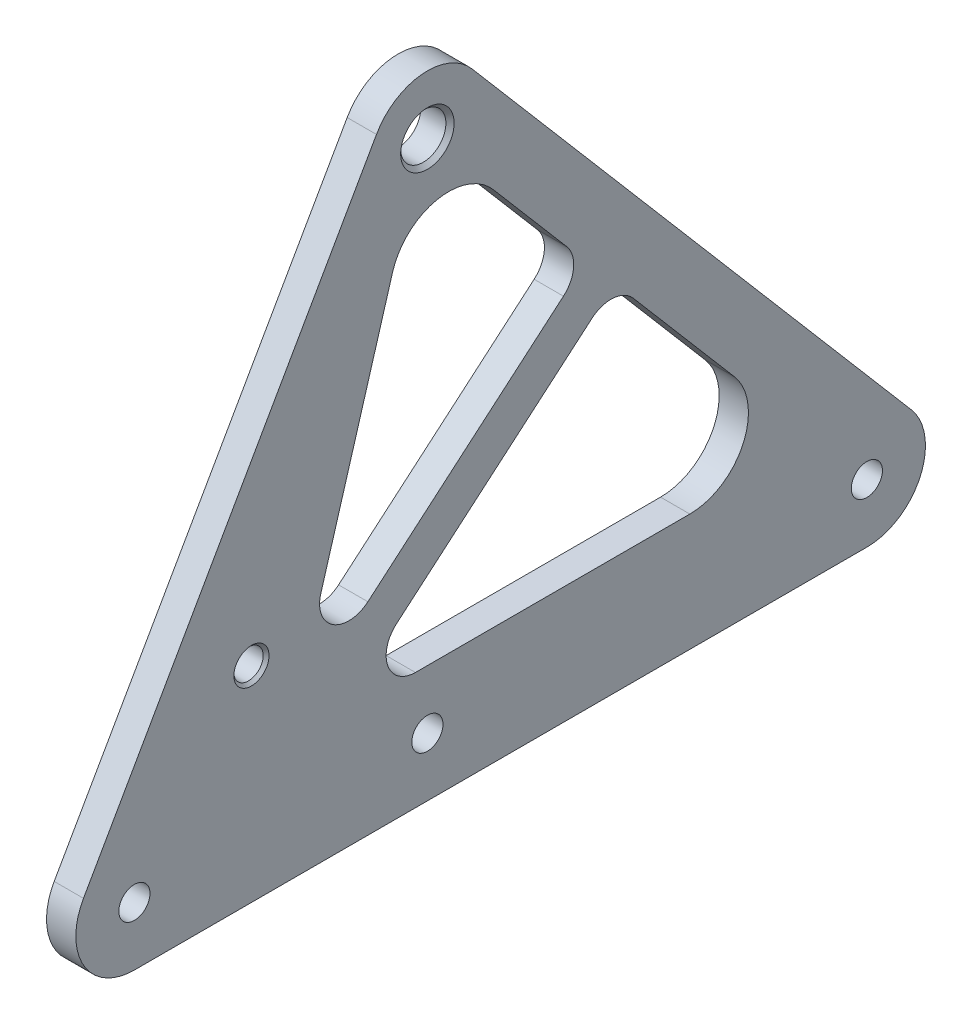
ISO-10303-21;
HEADER;
FILE_DESCRIPTION(('STEP AP214'),'2;1');
FILE_NAME('part.step','',(''),(''),'','','');
FILE_SCHEMA(('AUTOMOTIVE_DESIGN { 1 0 10303 214 1 1 1 1 }'));
ENDSEC;
DATA;
#1=APPLICATION_CONTEXT('core data for automotive mechanical design processes');
#2=APPLICATION_PROTOCOL_DEFINITION('international standard','automotive_design',2000,#1);
#3=PRODUCT_CONTEXT('',#1,'mechanical');
#4=PRODUCT('Part','Part','',(#3));
#5=PRODUCT_RELATED_PRODUCT_CATEGORY('part','',(#4));
#6=PRODUCT_DEFINITION_FORMATION('','',#4);
#7=PRODUCT_DEFINITION_CONTEXT('part definition',#1,'design');
#8=PRODUCT_DEFINITION('design','',#6,#7);
#9=PRODUCT_DEFINITION_SHAPE('','',#8);
#10=(LENGTH_UNIT() NAMED_UNIT(*) SI_UNIT(.MILLI.,.METRE.));
#11=(NAMED_UNIT(*) PLANE_ANGLE_UNIT() SI_UNIT($,.RADIAN.));
#12=(NAMED_UNIT(*) SI_UNIT($,.STERADIAN.) SOLID_ANGLE_UNIT());
#13=UNCERTAINTY_MEASURE_WITH_UNIT(LENGTH_MEASURE(1.E-05),#10,'distance_accuracy_value','');
#14=(GEOMETRIC_REPRESENTATION_CONTEXT(3) GLOBAL_UNCERTAINTY_ASSIGNED_CONTEXT((#13)) GLOBAL_UNIT_ASSIGNED_CONTEXT((#10,
#11,#12)) REPRESENTATION_CONTEXT('',''));
#15=CARTESIAN_POINT('',(0.,0.,0.));
#16=DIRECTION('',(0.,0.,1.));
#17=DIRECTION('',(1.,0.,0.));
#18=AXIS2_PLACEMENT_3D('',#15,#16,#17);
#19=CARTESIAN_POINT('',(6.35,0.,0.));
#20=DIRECTION('',(-1.,0.,0.));
#21=DIRECTION('',(0.,0.,1.));
#22=AXIS2_PLACEMENT_3D('',#19,#20,#21);
#23=CYLINDRICAL_SURFACE('',#22,12.7);
#24=CARTESIAN_POINT('',(0.,0.,0.));
#25=DIRECTION('',(1.,0.,0.));
#26=DIRECTION('',(0.,0.,-1.));
#27=AXIS2_PLACEMENT_3D('',#24,#25,#26);
#28=CIRCLE('',#27,12.7);
#29=CARTESIAN_POINT('',(0.,8.24330593271423,-9.66115455314108));
#30=VERTEX_POINT('',#29);
#31=CARTESIAN_POINT('',(0.,6.27931290545756,11.0390320877944));
#32=VERTEX_POINT('',#31);
#33=EDGE_CURVE('E283',#30,#32,#28,.T.);
#34=ORIENTED_EDGE('',*,*,#33,.T.);
#35=DIRECTION('',(-1.,0.,0.));
#36=VECTOR('',#35,1.);
#37=CARTESIAN_POINT('',(6.35,6.27931290545756,11.0390320877944));
#38=LINE('',#37,#36);
#39=CARTESIAN_POINT('',(6.35,6.27931290545756,11.0390320877944));
#40=VERTEX_POINT('',#39);
#41=EDGE_CURVE('E11',#40,#32,#38,.T.);
#42=ORIENTED_EDGE('',*,*,#41,.F.);
#43=CARTESIAN_POINT('',(6.35,0.,0.));
#44=DIRECTION('',(1.,0.,0.));
#45=DIRECTION('',(0.,0.,-1.));
#46=AXIS2_PLACEMENT_3D('',#43,#44,#45);
#47=CIRCLE('',#46,12.7);
#48=CARTESIAN_POINT('',(6.35,8.24330593271423,-9.66115455314108));
#49=VERTEX_POINT('',#48);
#50=EDGE_CURVE('E294',#49,#40,#47,.T.);
#51=ORIENTED_EDGE('',*,*,#50,.F.);
#52=DIRECTION('',(-1.,0.,0.));
#53=VECTOR('',#52,1.);
#54=CARTESIAN_POINT('',(6.35,8.24330593271423,-9.66115455314108));
#55=LINE('',#54,#53);
#56=EDGE_CURVE('E309',#49,#30,#55,.T.);
#57=ORIENTED_EDGE('',*,*,#56,.T.);
#58=EDGE_LOOP('',(#34,#42,#51,#57));
#59=FACE_BOUND('',#58,.T.);
#60=ADVANCED_FACE('F33',(#59),#23,.T.);
#61=CARTESIAN_POINT('',(6.35,-105.353687094542,74.5390320877944));
#62=DIRECTION('',(0.,0.494434087043902,0.86921512502318));
#63=DIRECTION('',(0.,-0.86921512502318,0.494434087043902));
#64=AXIS2_PLACEMENT_3D('',#61,#62,#63);
#65=PLANE('',#64);
#66=DIRECTION('',(0.,0.86921512502318,-0.494434087043902));
#67=VECTOR('',#66,1.);
#68=CARTESIAN_POINT('',(0.,-105.353687094542,74.5390320877944));
#69=LINE('',#68,#67);
#70=CARTESIAN_POINT('',(0.,-105.353687094542,74.5390320877944));
#71=VERTEX_POINT('',#70);
#72=EDGE_CURVE('E312',#71,#32,#69,.T.);
#73=ORIENTED_EDGE('',*,*,#72,.F.);
#74=DIRECTION('',(-1.,0.,0.));
#75=VECTOR('',#74,1.);
#76=CARTESIAN_POINT('',(6.35,-105.353687094542,74.5390320877944));
#77=LINE('',#76,#75);
#78=CARTESIAN_POINT('',(6.35,-105.353687094542,74.5390320877944));
#79=VERTEX_POINT('',#78);
#80=EDGE_CURVE('E40',#79,#71,#77,.T.);
#81=ORIENTED_EDGE('',*,*,#80,.F.);
#82=DIRECTION('',(0.,0.86921512502318,-0.494434087043902));
#83=VECTOR('',#82,1.);
#84=CARTESIAN_POINT('',(6.35,-105.353687094542,74.5390320877944));
#85=LINE('',#84,#83);
#86=EDGE_CURVE('E296',#79,#40,#85,.T.);
#87=ORIENTED_EDGE('',*,*,#86,.T.);
#88=ORIENTED_EDGE('',*,*,#41,.T.);
#89=EDGE_LOOP('',(#73,#81,#87,#88));
#90=FACE_BOUND('',#89,.T.);
#91=ADVANCED_FACE('F344',(#90),#65,.T.);
#92=CARTESIAN_POINT('',(6.35,-111.633,63.5));
#93=DIRECTION('',(-1.,0.,0.));
#94=DIRECTION('',(0.,0.,1.));
#95=AXIS2_PLACEMENT_3D('',#92,#93,#94);
#96=CYLINDRICAL_SURFACE('',#95,12.7);
#97=CARTESIAN_POINT('',(0.,-111.633,63.5));
#98=DIRECTION('',(1.,0.,0.));
#99=DIRECTION('',(0.,0.,-1.));
#100=AXIS2_PLACEMENT_3D('',#97,#98,#99);
#101=CIRCLE('',#100,12.7);
#102=CARTESIAN_POINT('',(0.,-124.333,63.5));
#103=VERTEX_POINT('',#102);
#104=EDGE_CURVE('E315',#71,#103,#101,.T.);
#105=ORIENTED_EDGE('',*,*,#104,.T.);
#106=DIRECTION('',(-1.,0.,0.));
#107=VECTOR('',#106,1.);
#108=CARTESIAN_POINT('',(6.35,-124.333,63.5));
#109=LINE('',#108,#107);
#110=CARTESIAN_POINT('',(6.35,-124.333,63.5));
#111=VERTEX_POINT('',#110);
#112=EDGE_CURVE('E330',#111,#103,#109,.T.);
#113=ORIENTED_EDGE('',*,*,#112,.F.);
#114=CARTESIAN_POINT('',(6.35,-111.633,63.5));
#115=DIRECTION('',(1.,0.,0.));
#116=DIRECTION('',(0.,0.,-1.));
#117=AXIS2_PLACEMENT_3D('',#114,#115,#116);
#118=CIRCLE('',#117,12.7);
#119=EDGE_CURVE('E300',#79,#111,#118,.T.);
#120=ORIENTED_EDGE('',*,*,#119,.F.);
#121=ORIENTED_EDGE('',*,*,#80,.T.);
#122=EDGE_LOOP('',(#105,#113,#120,#121));
#123=FACE_BOUND('',#122,.T.);
#124=ADVANCED_FACE('F335',(#123),#96,.T.);
#125=CARTESIAN_POINT('',(6.35,-124.333,63.5));
#126=DIRECTION('',(0.,1.,0.));
#127=DIRECTION('',(0.,0.,1.));
#128=AXIS2_PLACEMENT_3D('',#125,#126,#127);
#129=PLANE('',#128);
#130=DIRECTION('',(0.,0.,-1.));
#131=VECTOR('',#130,1.);
#132=CARTESIAN_POINT('',(0.,-124.333,63.5));
#133=LINE('',#132,#131);
#134=CARTESIAN_POINT('',(0.,-124.333,-95.25));
#135=VERTEX_POINT('',#134);
#136=EDGE_CURVE('E317',#103,#135,#133,.T.);
#137=ORIENTED_EDGE('',*,*,#136,.T.);
#138=DIRECTION('',(-1.,0.,0.));
#139=VECTOR('',#138,1.);
#140=CARTESIAN_POINT('',(6.35,-124.333,-95.25));
#141=LINE('',#140,#139);
#142=CARTESIAN_POINT('',(6.35,-124.333,-95.25));
#143=VERTEX_POINT('',#142);
#144=EDGE_CURVE('E327',#143,#135,#141,.T.);
#145=ORIENTED_EDGE('',*,*,#144,.F.);
#146=DIRECTION('',(0.,0.,-1.));
#147=VECTOR('',#146,1.);
#148=CARTESIAN_POINT('',(6.35,-124.333,63.5));
#149=LINE('',#148,#147);
#150=EDGE_CURVE('E302',#111,#143,#149,.T.);
#151=ORIENTED_EDGE('',*,*,#150,.F.);
#152=ORIENTED_EDGE('',*,*,#112,.T.);
#153=EDGE_LOOP('',(#137,#145,#151,#152));
#154=FACE_BOUND('',#153,.T.);
#155=ADVANCED_FACE('F359',(#154),#129,.F.);
#156=CARTESIAN_POINT('',(6.35,-111.633,-95.25));
#157=DIRECTION('',(-1.,0.,0.));
#158=DIRECTION('',(0.,0.,1.));
#159=AXIS2_PLACEMENT_3D('',#156,#157,#158);
#160=CYLINDRICAL_SURFACE('',#159,12.7);
#161=CARTESIAN_POINT('',(0.,-111.633,-95.25));
#162=DIRECTION('',(1.,0.,0.));
#163=DIRECTION('',(0.,0.,-1.));
#164=AXIS2_PLACEMENT_3D('',#161,#162,#163);
#165=CIRCLE('',#164,12.7);
#166=CARTESIAN_POINT('',(0.,-103.389694067286,-104.911154553141));
#167=VERTEX_POINT('',#166);
#168=EDGE_CURVE('E319',#135,#167,#165,.T.);
#169=ORIENTED_EDGE('',*,*,#168,.T.);
#170=DIRECTION('',(-1.,0.,0.));
#171=VECTOR('',#170,1.);
#172=CARTESIAN_POINT('',(6.35,-103.389694067286,-104.911154553141));
#173=LINE('',#172,#171);
#174=CARTESIAN_POINT('',(6.35,-103.389694067286,-104.911154553141));
#175=VERTEX_POINT('',#174);
#176=EDGE_CURVE('E325',#175,#167,#173,.T.);
#177=ORIENTED_EDGE('',*,*,#176,.F.);
#178=CARTESIAN_POINT('',(6.35,-111.633,-95.25));
#179=DIRECTION('',(1.,0.,0.));
#180=DIRECTION('',(0.,0.,-1.));
#181=AXIS2_PLACEMENT_3D('',#178,#179,#180);
#182=CIRCLE('',#181,12.7);
#183=EDGE_CURVE('E304',#143,#175,#182,.T.);
#184=ORIENTED_EDGE('',*,*,#183,.F.);
#185=ORIENTED_EDGE('',*,*,#144,.T.);
#186=EDGE_LOOP('',(#169,#177,#184,#185));
#187=FACE_BOUND('',#186,.T.);
#188=ADVANCED_FACE('F355',(#187),#160,.T.);
#189=CARTESIAN_POINT('',(6.35,8.24330593271423,-9.66115455314108));
#190=DIRECTION('',(0.,0.649079207300333,-0.76072083095599));
#191=DIRECTION('',(0.,0.76072083095599,0.649079207300333));
#192=AXIS2_PLACEMENT_3D('',#189,#190,#191);
#193=PLANE('',#192);
#194=DIRECTION('',(0.,-0.76072083095599,-0.649079207300333));
#195=VECTOR('',#194,1.);
#196=CARTESIAN_POINT('',(0.,8.24330593271423,-9.66115455314108));
#197=LINE('',#196,#195);
#198=EDGE_CURVE('E297',#30,#167,#197,.T.);
#199=ORIENTED_EDGE('',*,*,#198,.F.);
#200=ORIENTED_EDGE('',*,*,#56,.F.);
#201=DIRECTION('',(0.,-0.76072083095599,-0.649079207300333));
#202=VECTOR('',#201,1.);
#203=CARTESIAN_POINT('',(6.35,8.24330593271423,-9.66115455314108));
#204=LINE('',#203,#202);
#205=EDGE_CURVE('E306',#49,#175,#204,.T.);
#206=ORIENTED_EDGE('',*,*,#205,.T.);
#207=ORIENTED_EDGE('',*,*,#176,.T.);
#208=EDGE_LOOP('',(#199,#200,#206,#207));
#209=FACE_BOUND('',#208,.T.);
#210=ADVANCED_FACE('F350',(#209),#193,.T.);
#211=CARTESIAN_POINT('',(6.35,0.,0.));
#212=DIRECTION('',(1.,0.,0.));
#213=DIRECTION('',(0.,0.,-1.));
#214=AXIS2_PLACEMENT_3D('',#211,#212,#213);
#215=PLANE('',#214);
#216=CARTESIAN_POINT('',(6.35,-86.233,-56.8829530128024));
#217=DIRECTION('',(1.,0.,0.));
#218=DIRECTION('',(0.,0.,-1.));
#219=AXIS2_PLACEMENT_3D('',#216,#217,#218);
#220=CIRCLE('',#219,12.7);
#221=CARTESIAN_POINT('',(6.35,-98.933,-56.8829530128024));
#222=VERTEX_POINT('',#221);
#223=CARTESIAN_POINT('',(6.35,-77.9896940672858,-66.5441075659435));
#224=VERTEX_POINT('',#223);
#225=EDGE_CURVE('E47',#222,#224,#220,.T.);
#226=ORIENTED_EDGE('',*,*,#225,.F.);
#227=DIRECTION('',(0.,0.,-1.));
#228=VECTOR('',#227,1.);
#229=CARTESIAN_POINT('',(6.35,-98.933,2.59472714719857));
#230=LINE('',#229,#228);
#231=CARTESIAN_POINT('',(6.35,-98.933,2.59472714719857));
#232=VERTEX_POINT('',#231);
#233=EDGE_CURVE('E178',#232,#222,#230,.T.);
#234=ORIENTED_EDGE('',*,*,#233,.F.);
#235=CARTESIAN_POINT('',(6.35,-92.583,2.59472714719857));
#236=DIRECTION('',(1.,0.,0.));
#237=DIRECTION('',(0.,0.,1.));
#238=AXIS2_PLACEMENT_3D('',#235,#236,#237);
#239=CIRCLE('',#238,6.35);
#240=CARTESIAN_POINT('',(6.35,-87.7524227234295,6.71638011355568));
#241=VERTEX_POINT('',#240);
#242=EDGE_CURVE('E181',#241,#232,#239,.T.);
#243=ORIENTED_EDGE('',*,*,#242,.F.);
#244=DIRECTION('',(0.,-0.649079207300333,0.76072083095599));
#245=VECTOR('',#244,1.);
#246=CARTESIAN_POINT('',(6.35,-87.7524227234295,6.71638011355568));
#247=LINE('',#246,#245);
#248=CARTESIAN_POINT('',(6.35,-51.58731094225,-35.6691308939866));
#249=VERTEX_POINT('',#248);
#250=EDGE_CURVE('E197',#249,#241,#247,.T.);
#251=ORIENTED_EDGE('',*,*,#250,.F.);
#252=CARTESIAN_POINT('',(6.35,-56.4178882188206,-39.7907838603437));
#253=DIRECTION('',(1.,0.,0.));
#254=DIRECTION('',(0.,0.,-1.));
#255=AXIS2_PLACEMENT_3D('',#252,#253,#254);
#256=CIRCLE('',#255,6.35000000000001);
#257=CARTESIAN_POINT('',(6.35,-52.2962352524634,-44.6213611369142));
#258=VERTEX_POINT('',#257);
#259=EDGE_CURVE('E194',#258,#249,#256,.T.);
#260=ORIENTED_EDGE('',*,*,#259,.F.);
#261=DIRECTION('',(0.,0.76072083095599,0.649079207300333));
#262=VECTOR('',#261,1.);
#263=CARTESIAN_POINT('',(6.35,-77.9896940672858,-66.5441075659435));
#264=LINE('',#263,#262);
#265=EDGE_CURVE('E192',#224,#258,#264,.T.);
#266=ORIENTED_EDGE('',*,*,#265,.F.);
#267=EDGE_LOOP('',(#226,#234,#243,#251,#260,#266));
#268=FACE_BOUND('',#267,.T.);
#269=CARTESIAN_POINT('',(6.35,-39.5108677508237,-25.3649984780938));
#270=DIRECTION('',(1.,0.,0.));
#271=DIRECTION('',(0.,0.,1.));
#272=AXIS2_PLACEMENT_3D('',#269,#270,#271);
#273=CIRCLE('',#272,6.35);
#274=CARTESIAN_POINT('',(6.35,-44.3414450273942,-29.4866514444509));
#275=VERTEX_POINT('',#274);
#276=CARTESIAN_POINT('',(6.35,-35.3892147844666,-30.1955757546643));
#277=VERTEX_POINT('',#276);
#278=EDGE_CURVE('E55',#275,#277,#273,.T.);
#279=ORIENTED_EDGE('',*,*,#278,.F.);
#280=DIRECTION('',(0.,0.649079207300333,-0.76072083095599));
#281=VECTOR('',#280,1.);
#282=CARTESIAN_POINT('',(6.35,-80.5065568085737,12.8988595630914));
#283=LINE('',#282,#281);
#284=CARTESIAN_POINT('',(6.35,-80.5065568085737,12.8988595630913));
#285=VERTEX_POINT('',#284);
#286=EDGE_CURVE('E215',#285,#275,#283,.T.);
#287=ORIENTED_EDGE('',*,*,#286,.F.);
#288=CARTESIAN_POINT('',(6.35,-75.6759795320031,17.0205125294485));
#289=DIRECTION('',(1.,0.,0.));
#290=DIRECTION('',(0.,0.,1.));
#291=AXIS2_PLACEMENT_3D('',#288,#289,#290);
#292=CIRCLE('',#291,6.35);
#293=CARTESIAN_POINT('',(6.35,-73.8728328104251,23.1091217220689));
#294=VERTEX_POINT('',#293);
#295=EDGE_CURVE('E241',#294,#285,#292,.T.);
#296=ORIENTED_EDGE('',*,*,#295,.F.);
#297=DIRECTION('',(0.,-0.958836093326057,0.283960113634336));
#298=VECTOR('',#297,1.);
#299=CARTESIAN_POINT('',(6.35,-21.3706230353739,7.560548240587));
#300=LINE('',#299,#298);
#301=CARTESIAN_POINT('',(6.35,-21.3706230353739,7.56054824058699));
#302=VERTEX_POINT('',#301);
#303=EDGE_CURVE('E238',#302,#294,#300,.T.);
#304=ORIENTED_EDGE('',*,*,#303,.F.);
#305=CARTESIAN_POINT('',(6.35,-24.97691647853,-4.61667014465393));
#306=DIRECTION('',(1.,0.,0.));
#307=DIRECTION('',(0.,0.,-1.));
#308=AXIS2_PLACEMENT_3D('',#305,#306,#307);
#309=CIRCLE('',#308,12.7);
#310=CARTESIAN_POINT('',(6.35,-16.7336105458157,-14.277824697795));
#311=VERTEX_POINT('',#310);
#312=EDGE_CURVE('E235',#311,#302,#309,.T.);
#313=ORIENTED_EDGE('',*,*,#312,.F.);
#314=DIRECTION('',(0.,0.76072083095599,0.649079207300333));
#315=VECTOR('',#314,1.);
#316=CARTESIAN_POINT('',(6.35,-35.3892147844666,-30.1955757546643));
#317=LINE('',#316,#315);
#318=EDGE_CURVE('E232',#277,#311,#317,.T.);
#319=ORIENTED_EDGE('',*,*,#318,.F.);
#320=EDGE_LOOP('',(#279,#287,#296,#304,#313,#319));
#321=FACE_BOUND('',#320,.T.);
#322=CARTESIAN_POINT('',(6.35,-79.883,38.1342629932309));
#323=DIRECTION('',(1.,0.,0.));
#324=DIRECTION('',(0.,0.,-1.));
#325=AXIS2_PLACEMENT_3D('',#322,#323,#324);
#326=CIRCLE('',#325,3.80999999999999);
#327=CARTESIAN_POINT('',(6.35,-79.883,34.3242629932309));
#328=VERTEX_POINT('',#327);
#329=EDGE_CURVE('E248',#328,#328,#326,.T.);
#330=ORIENTED_EDGE('',*,*,#329,.F.);
#331=EDGE_LOOP('',(#330));
#332=FACE_BOUND('',#331,.T.);
#333=CARTESIAN_POINT('',(6.35,0.,0.));
#334=DIRECTION('',(1.,0.,0.));
#335=DIRECTION('',(0.,0.,-1.));
#336=AXIS2_PLACEMENT_3D('',#333,#334,#335);
#337=CIRCLE('',#336,5.79374);
#338=CARTESIAN_POINT('',(6.35,0.,-5.79374));
#339=VERTEX_POINT('',#338);
#340=EDGE_CURVE('E266',#339,#339,#337,.T.);
#341=ORIENTED_EDGE('',*,*,#340,.F.);
#342=EDGE_LOOP('',(#341));
#343=FACE_BOUND('',#342,.T.);
#344=CARTESIAN_POINT('',(6.35,-111.633,63.5));
#345=DIRECTION('',(1.,0.,0.));
#346=DIRECTION('',(0.,0.,-1.));
#347=AXIS2_PLACEMENT_3D('',#344,#345,#346);
#348=CIRCLE('',#347,3.3782);
#349=CARTESIAN_POINT('',(6.35,-111.633,60.1218));
#350=VERTEX_POINT('',#349);
#351=EDGE_CURVE('E276',#350,#350,#348,.T.);
#352=ORIENTED_EDGE('',*,*,#351,.F.);
#353=EDGE_LOOP('',(#352));
#354=FACE_BOUND('',#353,.T.);
#355=CARTESIAN_POINT('',(6.35,-111.633,0.));
#356=DIRECTION('',(1.,0.,0.));
#357=DIRECTION('',(0.,0.,-1.));
#358=AXIS2_PLACEMENT_3D('',#355,#356,#357);
#359=CIRCLE('',#358,3.37819999999999);
#360=CARTESIAN_POINT('',(6.35,-111.633,-3.3782));
#361=VERTEX_POINT('',#360);
#362=EDGE_CURVE('E284',#361,#361,#359,.T.);
#363=ORIENTED_EDGE('',*,*,#362,.F.);
#364=EDGE_LOOP('',(#363));
#365=FACE_BOUND('',#364,.T.);
#366=CARTESIAN_POINT('',(6.35,-111.633,-95.25));
#367=DIRECTION('',(1.,0.,0.));
#368=DIRECTION('',(0.,0.,-1.));
#369=AXIS2_PLACEMENT_3D('',#366,#367,#368);
#370=CIRCLE('',#369,3.37819999999999);
#371=CARTESIAN_POINT('',(6.35,-111.633,-98.6282));
#372=VERTEX_POINT('',#371);
#373=EDGE_CURVE('E275',#372,#372,#370,.T.);
#374=ORIENTED_EDGE('',*,*,#373,.F.);
#375=EDGE_LOOP('',(#374));
#376=FACE_BOUND('',#375,.T.);
#377=ORIENTED_EDGE('',*,*,#50,.T.);
#378=ORIENTED_EDGE('',*,*,#86,.F.);
#379=ORIENTED_EDGE('',*,*,#119,.T.);
#380=ORIENTED_EDGE('',*,*,#150,.T.);
#381=ORIENTED_EDGE('',*,*,#183,.T.);
#382=ORIENTED_EDGE('',*,*,#205,.F.);
#383=EDGE_LOOP('',(#377,#378,#379,#380,#381,#382));
#384=FACE_BOUND('',#383,.T.);
#385=ADVANCED_FACE('F361',(#268,#321,#332,#343,#354,#365,#376,#384),#215,.T.);
#386=CARTESIAN_POINT('',(0.,0.,0.));
#387=DIRECTION('',(1.,0.,0.));
#388=DIRECTION('',(0.,0.,-1.));
#389=AXIS2_PLACEMENT_3D('',#386,#387,#388);
#390=PLANE('',#389);
#391=DIRECTION('',(0.,0.,-1.));
#392=VECTOR('',#391,1.);
#393=CARTESIAN_POINT('',(0.,-98.933,2.59472714719857));
#394=LINE('',#393,#392);
#395=CARTESIAN_POINT('',(0.,-98.933,2.59472714719857));
#396=VERTEX_POINT('',#395);
#397=CARTESIAN_POINT('',(0.,-98.933,-56.8829530128024));
#398=VERTEX_POINT('',#397);
#399=EDGE_CURVE('E164',#396,#398,#394,.T.);
#400=ORIENTED_EDGE('',*,*,#399,.T.);
#401=CARTESIAN_POINT('',(0.,-86.233,-56.8829530128024));
#402=DIRECTION('',(1.,0.,0.));
#403=DIRECTION('',(0.,0.,-1.));
#404=AXIS2_PLACEMENT_3D('',#401,#402,#403);
#405=CIRCLE('',#404,12.7);
#406=CARTESIAN_POINT('',(0.,-77.9896940672858,-66.5441075659435));
#407=VERTEX_POINT('',#406);
#408=EDGE_CURVE('E158',#398,#407,#405,.T.);
#409=ORIENTED_EDGE('',*,*,#408,.T.);
#410=DIRECTION('',(0.,0.76072083095599,0.649079207300333));
#411=VECTOR('',#410,1.);
#412=CARTESIAN_POINT('',(0.,-77.9896940672858,-66.5441075659435));
#413=LINE('',#412,#411);
#414=CARTESIAN_POINT('',(0.,-52.2962352524635,-44.6213611369142));
#415=VERTEX_POINT('',#414);
#416=EDGE_CURVE('E168',#407,#415,#413,.T.);
#417=ORIENTED_EDGE('',*,*,#416,.T.);
#418=CARTESIAN_POINT('',(0.,-56.4178882188206,-39.7907838603437));
#419=DIRECTION('',(1.,0.,0.));
#420=DIRECTION('',(0.,0.,-1.));
#421=AXIS2_PLACEMENT_3D('',#418,#419,#420);
#422=CIRCLE('',#421,6.35000000000001);
#423=CARTESIAN_POINT('',(0.,-51.58731094225,-35.6691308939866));
#424=VERTEX_POINT('',#423);
#425=EDGE_CURVE('E172',#415,#424,#422,.T.);
#426=ORIENTED_EDGE('',*,*,#425,.T.);
#427=DIRECTION('',(0.,-0.649079207300333,0.76072083095599));
#428=VECTOR('',#427,1.);
#429=CARTESIAN_POINT('',(0.,-87.7524227234295,6.71638011355568));
#430=LINE('',#429,#428);
#431=CARTESIAN_POINT('',(0.,-87.7524227234295,6.71638011355568));
#432=VERTEX_POINT('',#431);
#433=EDGE_CURVE('E185',#424,#432,#430,.T.);
#434=ORIENTED_EDGE('',*,*,#433,.T.);
#435=CARTESIAN_POINT('',(0.,-92.583,2.59472714719857));
#436=DIRECTION('',(1.,0.,0.));
#437=DIRECTION('',(0.,0.,1.));
#438=AXIS2_PLACEMENT_3D('',#435,#436,#437);
#439=CIRCLE('',#438,6.35);
#440=EDGE_CURVE('E188',#432,#396,#439,.T.);
#441=ORIENTED_EDGE('',*,*,#440,.T.);
#442=EDGE_LOOP('',(#400,#409,#417,#426,#434,#441));
#443=FACE_BOUND('',#442,.T.);
#444=DIRECTION('',(0.,0.649079207300333,-0.76072083095599));
#445=VECTOR('',#444,1.);
#446=CARTESIAN_POINT('',(0.,-80.5065568085737,12.8988595630914));
#447=LINE('',#446,#445);
#448=CARTESIAN_POINT('',(0.,-80.5065568085737,12.8988595630913));
#449=VERTEX_POINT('',#448);
#450=CARTESIAN_POINT('',(0.,-44.3414450273942,-29.4866514444509));
#451=VERTEX_POINT('',#450);
#452=EDGE_CURVE('E227',#449,#451,#447,.T.);
#453=ORIENTED_EDGE('',*,*,#452,.T.);
#454=CARTESIAN_POINT('',(0.,-39.5108677508237,-25.3649984780938));
#455=DIRECTION('',(1.,0.,0.));
#456=DIRECTION('',(0.,0.,1.));
#457=AXIS2_PLACEMENT_3D('',#454,#455,#456);
#458=CIRCLE('',#457,6.35);
#459=CARTESIAN_POINT('',(0.,-35.3892147844666,-30.1955757546643));
#460=VERTEX_POINT('',#459);
#461=EDGE_CURVE('E211',#451,#460,#458,.T.);
#462=ORIENTED_EDGE('',*,*,#461,.T.);
#463=DIRECTION('',(0.,0.76072083095599,0.649079207300333));
#464=VECTOR('',#463,1.);
#465=CARTESIAN_POINT('',(0.,-35.3892147844666,-30.1955757546643));
#466=LINE('',#465,#464);
#467=CARTESIAN_POINT('',(0.,-16.7336105458157,-14.277824697795));
#468=VERTEX_POINT('',#467);
#469=EDGE_CURVE('E214',#460,#468,#466,.T.);
#470=ORIENTED_EDGE('',*,*,#469,.T.);
#471=CARTESIAN_POINT('',(0.,-24.97691647853,-4.61667014465393));
#472=DIRECTION('',(1.,0.,0.));
#473=DIRECTION('',(0.,0.,-1.));
#474=AXIS2_PLACEMENT_3D('',#471,#472,#473);
#475=CIRCLE('',#474,12.7);
#476=CARTESIAN_POINT('',(0.,-21.3706230353739,7.56054824058699));
#477=VERTEX_POINT('',#476);
#478=EDGE_CURVE('E218',#468,#477,#475,.T.);
#479=ORIENTED_EDGE('',*,*,#478,.T.);
#480=DIRECTION('',(0.,-0.958836093326057,0.283960113634336));
#481=VECTOR('',#480,1.);
#482=CARTESIAN_POINT('',(0.,-21.3706230353739,7.560548240587));
#483=LINE('',#482,#481);
#484=CARTESIAN_POINT('',(0.,-73.8728328104251,23.1091217220689));
#485=VERTEX_POINT('',#484);
#486=EDGE_CURVE('E221',#477,#485,#483,.T.);
#487=ORIENTED_EDGE('',*,*,#486,.T.);
#488=CARTESIAN_POINT('',(0.,-75.6759795320031,17.0205125294485));
#489=DIRECTION('',(1.,0.,0.));
#490=DIRECTION('',(0.,0.,1.));
#491=AXIS2_PLACEMENT_3D('',#488,#489,#490);
#492=CIRCLE('',#491,6.35);
#493=EDGE_CURVE('E224',#485,#449,#492,.T.);
#494=ORIENTED_EDGE('',*,*,#493,.T.);
#495=EDGE_LOOP('',(#453,#462,#470,#479,#487,#494));
#496=FACE_BOUND('',#495,.T.);
#497=CARTESIAN_POINT('',(0.,-79.883,38.1342629932309));
#498=DIRECTION('',(1.,0.,0.));
#499=DIRECTION('',(0.,0.,-1.));
#500=AXIS2_PLACEMENT_3D('',#497,#498,#499);
#501=CIRCLE('',#500,3.175);
#502=CARTESIAN_POINT('',(0.,-79.883,34.9592629932309));
#503=VERTEX_POINT('',#502);
#504=EDGE_CURVE('E263',#503,#503,#501,.T.);
#505=ORIENTED_EDGE('',*,*,#504,.T.);
#506=EDGE_LOOP('',(#505));
#507=FACE_BOUND('',#506,.T.);
#508=CARTESIAN_POINT('',(0.,0.,0.));
#509=DIRECTION('',(1.,0.,0.));
#510=DIRECTION('',(0.,0.,-1.));
#511=AXIS2_PLACEMENT_3D('',#508,#509,#510);
#512=CIRCLE('',#511,4.90219999999999);
#513=CARTESIAN_POINT('',(0.,0.,-4.90219999999999));
#514=VERTEX_POINT('',#513);
#515=EDGE_CURVE('E272',#514,#514,#512,.T.);
#516=ORIENTED_EDGE('',*,*,#515,.T.);
#517=EDGE_LOOP('',(#516));
#518=FACE_BOUND('',#517,.T.);
#519=CARTESIAN_POINT('',(0.,-111.633,63.5));
#520=DIRECTION('',(1.,0.,0.));
#521=DIRECTION('',(0.,0.,-1.));
#522=AXIS2_PLACEMENT_3D('',#519,#520,#521);
#523=CIRCLE('',#522,3.3782);
#524=CARTESIAN_POINT('',(0.,-111.633,60.1218));
#525=VERTEX_POINT('',#524);
#526=EDGE_CURVE('E279',#525,#525,#523,.F.);
#527=ORIENTED_EDGE('',*,*,#526,.F.);
#528=EDGE_LOOP('',(#527));
#529=FACE_BOUND('',#528,.T.);
#530=CARTESIAN_POINT('',(0.,-111.633,0.));
#531=DIRECTION('',(1.,0.,0.));
#532=DIRECTION('',(0.,0.,-1.));
#533=AXIS2_PLACEMENT_3D('',#530,#531,#532);
#534=CIRCLE('',#533,3.37819999999999);
#535=CARTESIAN_POINT('',(0.,-111.633,-3.3782));
#536=VERTEX_POINT('',#535);
#537=EDGE_CURVE('E280',#536,#536,#534,.F.);
#538=ORIENTED_EDGE('',*,*,#537,.F.);
#539=EDGE_LOOP('',(#538));
#540=FACE_BOUND('',#539,.T.);
#541=CARTESIAN_POINT('',(0.,-111.633,-95.25));
#542=DIRECTION('',(1.,0.,0.));
#543=DIRECTION('',(0.,0.,-1.));
#544=AXIS2_PLACEMENT_3D('',#541,#542,#543);
#545=CIRCLE('',#544,3.37819999999999);
#546=CARTESIAN_POINT('',(0.,-111.633,-98.6282));
#547=VERTEX_POINT('',#546);
#548=EDGE_CURVE('E287',#547,#547,#545,.F.);
#549=ORIENTED_EDGE('',*,*,#548,.F.);
#550=EDGE_LOOP('',(#549));
#551=FACE_BOUND('',#550,.T.);
#552=ORIENTED_EDGE('',*,*,#33,.F.);
#553=ORIENTED_EDGE('',*,*,#198,.T.);
#554=ORIENTED_EDGE('',*,*,#168,.F.);
#555=ORIENTED_EDGE('',*,*,#136,.F.);
#556=ORIENTED_EDGE('',*,*,#104,.F.);
#557=ORIENTED_EDGE('',*,*,#72,.T.);
#558=EDGE_LOOP('',(#552,#553,#554,#555,#556,#557));
#559=FACE_BOUND('',#558,.T.);
#560=ADVANCED_FACE('F174',(#443,#496,#507,#518,#529,#540,#551,#559),#390,.F.);
#561=CARTESIAN_POINT('',(-0.00100000000000013,-111.633,-95.25));
#562=DIRECTION('',(1.,0.,0.));
#563=DIRECTION('',(0.,0.,-1.));
#564=AXIS2_PLACEMENT_3D('',#561,#562,#563);
#565=CYLINDRICAL_SURFACE('',#564,3.37819999999999);
#566=ORIENTED_EDGE('',*,*,#373,.T.);
#567=EDGE_LOOP('',(#566));
#568=FACE_BOUND('',#567,.T.);
#569=ORIENTED_EDGE('',*,*,#548,.T.);
#570=EDGE_LOOP('',(#569));
#571=FACE_BOUND('',#570,.T.);
#572=ADVANCED_FACE('F369',(#568,#571),#565,.F.);
#573=CARTESIAN_POINT('',(-0.00100000000000013,-111.633,0.));
#574=DIRECTION('',(1.,0.,0.));
#575=DIRECTION('',(0.,0.,-1.));
#576=AXIS2_PLACEMENT_3D('',#573,#574,#575);
#577=CYLINDRICAL_SURFACE('',#576,3.37819999999999);
#578=ORIENTED_EDGE('',*,*,#362,.T.);
#579=EDGE_LOOP('',(#578));
#580=FACE_BOUND('',#579,.T.);
#581=ORIENTED_EDGE('',*,*,#537,.T.);
#582=EDGE_LOOP('',(#581));
#583=FACE_BOUND('',#582,.T.);
#584=ADVANCED_FACE('F404',(#580,#583),#577,.F.);
#585=CARTESIAN_POINT('',(-0.00100000000000013,-111.633,63.5));
#586=DIRECTION('',(1.,0.,0.));
#587=DIRECTION('',(0.,0.,-1.));
#588=AXIS2_PLACEMENT_3D('',#585,#586,#587);
#589=CYLINDRICAL_SURFACE('',#588,3.3782);
#590=ORIENTED_EDGE('',*,*,#351,.T.);
#591=EDGE_LOOP('',(#590));
#592=FACE_BOUND('',#591,.T.);
#593=ORIENTED_EDGE('',*,*,#526,.T.);
#594=EDGE_LOOP('',(#593));
#595=FACE_BOUND('',#594,.T.);
#596=ADVANCED_FACE('F414',(#592,#595),#589,.F.);
#597=CARTESIAN_POINT('',(6.35,0.,0.));
#598=DIRECTION('',(1.,0.,0.));
#599=DIRECTION('',(0.,0.,-1.));
#600=AXIS2_PLACEMENT_3D('',#597,#598,#599);
#601=CYLINDRICAL_SURFACE('',#600,4.90219999999999);
#602=ORIENTED_EDGE('',*,*,#515,.F.);
#603=EDGE_LOOP('',(#602));
#604=FACE_BOUND('',#603,.T.);
#605=CARTESIAN_POINT('',(5.45846,0.,0.));
#606=DIRECTION('',(1.,0.,0.));
#607=DIRECTION('',(0.,0.,-1.));
#608=AXIS2_PLACEMENT_3D('',#605,#606,#607);
#609=CIRCLE('',#608,4.9022);
#610=CARTESIAN_POINT('',(5.45846,0.,-4.9022));
#611=VERTEX_POINT('',#610);
#612=EDGE_CURVE('E269',#611,#611,#609,.T.);
#613=ORIENTED_EDGE('',*,*,#612,.T.);
#614=EDGE_LOOP('',(#613));
#615=FACE_BOUND('',#614,.T.);
#616=ADVANCED_FACE('F424',(#604,#615),#601,.F.);
#617=CARTESIAN_POINT('',(6.35,0.,0.));
#618=DIRECTION('',(1.,0.,0.));
#619=DIRECTION('',(0.,0.,-1.));
#620=AXIS2_PLACEMENT_3D('',#617,#618,#619);
#621=CONICAL_SURFACE('',#620,5.79374,0.785398163397449);
#622=ORIENTED_EDGE('',*,*,#612,.F.);
#623=EDGE_LOOP('',(#622));
#624=FACE_BOUND('',#623,.T.);
#625=ORIENTED_EDGE('',*,*,#340,.T.);
#626=EDGE_LOOP('',(#625));
#627=FACE_BOUND('',#626,.T.);
#628=ADVANCED_FACE('F434',(#624,#627),#621,.F.);
#629=CARTESIAN_POINT('',(6.35,-79.883,38.1342629932309));
#630=DIRECTION('',(1.,0.,0.));
#631=DIRECTION('',(0.,0.,-1.));
#632=AXIS2_PLACEMENT_3D('',#629,#630,#631);
#633=CYLINDRICAL_SURFACE('',#632,3.175);
#634=ORIENTED_EDGE('',*,*,#504,.F.);
#635=EDGE_LOOP('',(#634));
#636=FACE_BOUND('',#635,.T.);
#637=CARTESIAN_POINT('',(5.715,-79.883,38.1342629932309));
#638=DIRECTION('',(1.,0.,0.));
#639=DIRECTION('',(0.,0.,-1.));
#640=AXIS2_PLACEMENT_3D('',#637,#638,#639);
#641=CIRCLE('',#640,3.175);
#642=CARTESIAN_POINT('',(5.715,-79.883,34.9592629932309));
#643=VERTEX_POINT('',#642);
#644=EDGE_CURVE('E260',#643,#643,#641,.T.);
#645=ORIENTED_EDGE('',*,*,#644,.T.);
#646=EDGE_LOOP('',(#645));
#647=FACE_BOUND('',#646,.T.);
#648=ADVANCED_FACE('F444',(#636,#647),#633,.F.);
#649=CARTESIAN_POINT('',(6.35,-79.883,38.1342629932309));
#650=DIRECTION('',(1.,0.,0.));
#651=DIRECTION('',(0.,0.,-1.));
#652=AXIS2_PLACEMENT_3D('',#649,#650,#651);
#653=CONICAL_SURFACE('',#652,3.80999999999999,0.785398163397446);
#654=ORIENTED_EDGE('',*,*,#644,.F.);
#655=EDGE_LOOP('',(#654));
#656=FACE_BOUND('',#655,.T.);
#657=ORIENTED_EDGE('',*,*,#329,.T.);
#658=EDGE_LOOP('',(#657));
#659=FACE_BOUND('',#658,.T.);
#660=ADVANCED_FACE('F454',(#656,#659),#653,.F.);
#661=CARTESIAN_POINT('',(0.,-39.5108677508237,-25.3649984780938));
#662=DIRECTION('',(1.,0.,0.));
#663=DIRECTION('',(0.,0.,-1.));
#664=AXIS2_PLACEMENT_3D('',#661,#662,#663);
#665=CYLINDRICAL_SURFACE('',#664,6.35);
#666=ORIENTED_EDGE('',*,*,#278,.T.);
#667=DIRECTION('',(1.,0.,0.));
#668=VECTOR('',#667,1.);
#669=CARTESIAN_POINT('',(0.,-35.3892147844666,-30.1955757546643));
#670=LINE('',#669,#668);
#671=EDGE_CURVE('E230',#460,#277,#670,.T.);
#672=ORIENTED_EDGE('',*,*,#671,.F.);
#673=ORIENTED_EDGE('',*,*,#461,.F.);
#674=DIRECTION('',(1.,0.,0.));
#675=VECTOR('',#674,1.);
#676=CARTESIAN_POINT('',(0.,-44.3414450273942,-29.4866514444509));
#677=LINE('',#676,#675);
#678=EDGE_CURVE('E246',#451,#275,#677,.T.);
#679=ORIENTED_EDGE('',*,*,#678,.T.);
#680=EDGE_LOOP('',(#666,#672,#673,#679));
#681=FACE_BOUND('',#680,.T.);
#682=ADVANCED_FACE('F463',(#681),#665,.F.);
#683=CARTESIAN_POINT('',(0.,-80.5065568085737,12.8988595630914));
#684=DIRECTION('',(0.,-0.76072083095599,-0.649079207300333));
#685=DIRECTION('',(0.,0.649079207300333,-0.76072083095599));
#686=AXIS2_PLACEMENT_3D('',#683,#684,#685);
#687=PLANE('',#686);
#688=ORIENTED_EDGE('',*,*,#286,.T.);
#689=ORIENTED_EDGE('',*,*,#678,.F.);
#690=ORIENTED_EDGE('',*,*,#452,.F.);
#691=DIRECTION('',(1.,0.,0.));
#692=VECTOR('',#691,1.);
#693=CARTESIAN_POINT('',(0.,-80.5065568085737,12.8988595630913));
#694=LINE('',#693,#692);
#695=EDGE_CURVE('E249',#449,#285,#694,.T.);
#696=ORIENTED_EDGE('',*,*,#695,.T.);
#697=EDGE_LOOP('',(#688,#689,#690,#696));
#698=FACE_BOUND('',#697,.T.);
#699=ADVANCED_FACE('F482',(#698),#687,.F.);
#700=CARTESIAN_POINT('',(0.,-75.6759795320031,17.0205125294485));
#701=DIRECTION('',(1.,0.,0.));
#702=DIRECTION('',(0.,0.,-1.));
#703=AXIS2_PLACEMENT_3D('',#700,#701,#702);
#704=CYLINDRICAL_SURFACE('',#703,6.35);
#705=ORIENTED_EDGE('',*,*,#295,.T.);
#706=ORIENTED_EDGE('',*,*,#695,.F.);
#707=ORIENTED_EDGE('',*,*,#493,.F.);
#708=DIRECTION('',(1.,0.,0.));
#709=VECTOR('',#708,1.);
#710=CARTESIAN_POINT('',(0.,-73.8728328104251,23.1091217220689));
#711=LINE('',#710,#709);
#712=EDGE_CURVE('E251',#485,#294,#711,.T.);
#713=ORIENTED_EDGE('',*,*,#712,.T.);
#714=EDGE_LOOP('',(#705,#706,#707,#713));
#715=FACE_BOUND('',#714,.T.);
#716=ADVANCED_FACE('F491',(#715),#704,.F.);
#717=CARTESIAN_POINT('',(0.,-21.3706230353739,7.560548240587));
#718=DIRECTION('',(0.,0.283960113634336,0.958836093326057));
#719=DIRECTION('',(0.,-0.958836093326057,0.283960113634336));
#720=AXIS2_PLACEMENT_3D('',#717,#718,#719);
#721=PLANE('',#720);
#722=ORIENTED_EDGE('',*,*,#303,.T.);
#723=ORIENTED_EDGE('',*,*,#712,.F.);
#724=ORIENTED_EDGE('',*,*,#486,.F.);
#725=DIRECTION('',(1.,0.,0.));
#726=VECTOR('',#725,1.);
#727=CARTESIAN_POINT('',(0.,-21.3706230353739,7.56054824058699));
#728=LINE('',#727,#726);
#729=EDGE_CURVE('E253',#477,#302,#728,.T.);
#730=ORIENTED_EDGE('',*,*,#729,.T.);
#731=EDGE_LOOP('',(#722,#723,#724,#730));
#732=FACE_BOUND('',#731,.T.);
#733=ADVANCED_FACE('F501',(#732),#721,.F.);
#734=CARTESIAN_POINT('',(0.,-24.97691647853,-4.61667014465393));
#735=DIRECTION('',(1.,0.,0.));
#736=DIRECTION('',(0.,0.,-1.));
#737=AXIS2_PLACEMENT_3D('',#734,#735,#736);
#738=CYLINDRICAL_SURFACE('',#737,12.7);
#739=ORIENTED_EDGE('',*,*,#312,.T.);
#740=ORIENTED_EDGE('',*,*,#729,.F.);
#741=ORIENTED_EDGE('',*,*,#478,.F.);
#742=DIRECTION('',(1.,0.,0.));
#743=VECTOR('',#742,1.);
#744=CARTESIAN_POINT('',(0.,-16.7336105458157,-14.277824697795));
#745=LINE('',#744,#743);
#746=EDGE_CURVE('E255',#468,#311,#745,.T.);
#747=ORIENTED_EDGE('',*,*,#746,.T.);
#748=EDGE_LOOP('',(#739,#740,#741,#747));
#749=FACE_BOUND('',#748,.T.);
#750=ADVANCED_FACE('F511',(#749),#738,.F.);
#751=CARTESIAN_POINT('',(0.,-35.3892147844666,-30.1955757546643));
#752=DIRECTION('',(0.,0.649079207300333,-0.76072083095599));
#753=DIRECTION('',(0.,0.76072083095599,0.649079207300333));
#754=AXIS2_PLACEMENT_3D('',#751,#752,#753);
#755=PLANE('',#754);
#756=ORIENTED_EDGE('',*,*,#318,.T.);
#757=ORIENTED_EDGE('',*,*,#746,.F.);
#758=ORIENTED_EDGE('',*,*,#469,.F.);
#759=ORIENTED_EDGE('',*,*,#671,.T.);
#760=EDGE_LOOP('',(#756,#757,#758,#759));
#761=FACE_BOUND('',#760,.T.);
#762=ADVANCED_FACE('F521',(#761),#755,.F.);
#763=CARTESIAN_POINT('',(0.,-86.233,-56.8829530128024));
#764=DIRECTION('',(1.,0.,0.));
#765=DIRECTION('',(0.,0.,-1.));
#766=AXIS2_PLACEMENT_3D('',#763,#764,#765);
#767=CYLINDRICAL_SURFACE('',#766,12.7);
#768=ORIENTED_EDGE('',*,*,#225,.T.);
#769=DIRECTION('',(1.,0.,0.));
#770=VECTOR('',#769,1.);
#771=CARTESIAN_POINT('',(0.,-77.9896940672858,-66.5441075659435));
#772=LINE('',#771,#770);
#773=EDGE_CURVE('E154',#407,#224,#772,.T.);
#774=ORIENTED_EDGE('',*,*,#773,.F.);
#775=ORIENTED_EDGE('',*,*,#408,.F.);
#776=DIRECTION('',(1.,0.,0.));
#777=VECTOR('',#776,1.);
#778=CARTESIAN_POINT('',(0.,-98.933,-56.8829530128024));
#779=LINE('',#778,#777);
#780=EDGE_CURVE('E202',#398,#222,#779,.T.);
#781=ORIENTED_EDGE('',*,*,#780,.T.);
#782=EDGE_LOOP('',(#768,#774,#775,#781));
#783=FACE_BOUND('',#782,.T.);
#784=ADVANCED_FACE('F156',(#783),#767,.F.);
#785=CARTESIAN_POINT('',(0.,-98.933,2.59472714719857));
#786=DIRECTION('',(0.,-1.,0.));
#787=DIRECTION('',(0.,0.,-1.));
#788=AXIS2_PLACEMENT_3D('',#785,#786,#787);
#789=PLANE('',#788);
#790=ORIENTED_EDGE('',*,*,#233,.T.);
#791=ORIENTED_EDGE('',*,*,#780,.F.);
#792=ORIENTED_EDGE('',*,*,#399,.F.);
#793=DIRECTION('',(1.,0.,0.));
#794=VECTOR('',#793,1.);
#795=CARTESIAN_POINT('',(0.,-98.933,2.59472714719857));
#796=LINE('',#795,#794);
#797=EDGE_CURVE('E204',#396,#232,#796,.T.);
#798=ORIENTED_EDGE('',*,*,#797,.T.);
#799=EDGE_LOOP('',(#790,#791,#792,#798));
#800=FACE_BOUND('',#799,.T.);
#801=ADVANCED_FACE('F540',(#800),#789,.F.);
#802=CARTESIAN_POINT('',(0.,-92.583,2.59472714719857));
#803=DIRECTION('',(1.,0.,0.));
#804=DIRECTION('',(0.,0.,-1.));
#805=AXIS2_PLACEMENT_3D('',#802,#803,#804);
#806=CYLINDRICAL_SURFACE('',#805,6.35);
#807=ORIENTED_EDGE('',*,*,#242,.T.);
#808=ORIENTED_EDGE('',*,*,#797,.F.);
#809=ORIENTED_EDGE('',*,*,#440,.F.);
#810=DIRECTION('',(1.,0.,0.));
#811=VECTOR('',#810,1.);
#812=CARTESIAN_POINT('',(0.,-87.7524227234295,6.71638011355568));
#813=LINE('',#812,#811);
#814=EDGE_CURVE('E206',#432,#241,#813,.T.);
#815=ORIENTED_EDGE('',*,*,#814,.T.);
#816=EDGE_LOOP('',(#807,#808,#809,#815));
#817=FACE_BOUND('',#816,.T.);
#818=ADVANCED_FACE('F549',(#817),#806,.F.);
#819=CARTESIAN_POINT('',(0.,-87.7524227234295,6.71638011355568));
#820=DIRECTION('',(0.,0.76072083095599,0.649079207300333));
#821=DIRECTION('',(0.,-0.649079207300333,0.76072083095599));
#822=AXIS2_PLACEMENT_3D('',#819,#820,#821);
#823=PLANE('',#822);
#824=ORIENTED_EDGE('',*,*,#250,.T.);
#825=ORIENTED_EDGE('',*,*,#814,.F.);
#826=ORIENTED_EDGE('',*,*,#433,.F.);
#827=DIRECTION('',(1.,0.,0.));
#828=VECTOR('',#827,1.);
#829=CARTESIAN_POINT('',(0.,-51.58731094225,-35.6691308939866));
#830=LINE('',#829,#828);
#831=EDGE_CURVE('E208',#424,#249,#830,.T.);
#832=ORIENTED_EDGE('',*,*,#831,.T.);
#833=EDGE_LOOP('',(#824,#825,#826,#832));
#834=FACE_BOUND('',#833,.T.);
#835=ADVANCED_FACE('F559',(#834),#823,.F.);
#836=CARTESIAN_POINT('',(0.,-56.4178882188206,-39.7907838603437));
#837=DIRECTION('',(1.,0.,0.));
#838=DIRECTION('',(0.,0.,-1.));
#839=AXIS2_PLACEMENT_3D('',#836,#837,#838);
#840=CYLINDRICAL_SURFACE('',#839,6.35000000000001);
#841=ORIENTED_EDGE('',*,*,#259,.T.);
#842=ORIENTED_EDGE('',*,*,#831,.F.);
#843=ORIENTED_EDGE('',*,*,#425,.F.);
#844=DIRECTION('',(1.,0.,0.));
#845=VECTOR('',#844,1.);
#846=CARTESIAN_POINT('',(0.,-52.2962352524634,-44.6213611369142));
#847=LINE('',#846,#845);
#848=EDGE_CURVE('E163',#415,#258,#847,.T.);
#849=ORIENTED_EDGE('',*,*,#848,.T.);
#850=EDGE_LOOP('',(#841,#842,#843,#849));
#851=FACE_BOUND('',#850,.T.);
#852=ADVANCED_FACE('F569',(#851),#840,.F.);
#853=CARTESIAN_POINT('',(0.,-77.9896940672858,-66.5441075659435));
#854=DIRECTION('',(0.,0.649079207300333,-0.76072083095599));
#855=DIRECTION('',(0.,0.76072083095599,0.649079207300333));
#856=AXIS2_PLACEMENT_3D('',#853,#854,#855);
#857=PLANE('',#856);
#858=ORIENTED_EDGE('',*,*,#265,.T.);
#859=ORIENTED_EDGE('',*,*,#848,.F.);
#860=ORIENTED_EDGE('',*,*,#416,.F.);
#861=ORIENTED_EDGE('',*,*,#773,.T.);
#862=EDGE_LOOP('',(#858,#859,#860,#861));
#863=FACE_BOUND('',#862,.T.);
#864=ADVANCED_FACE('F169',(#863),#857,.F.);
#865=CLOSED_SHELL('',(#60,#91,#124,#155,#188,#210,#385,#560,#572,#584,#596,#616,#628,#648,#660,
#682,#699,#716,#733,#750,#762,#784,#801,#818,#835,#852,#864));
#866=MANIFOLD_SOLID_BREP('B2',#865);
#867=ADVANCED_BREP_SHAPE_REPRESENTATION('',(#18,#866),#14);
#868=SHAPE_DEFINITION_REPRESENTATION(#9,#867);
ENDSEC;
END-ISO-10303-21;
